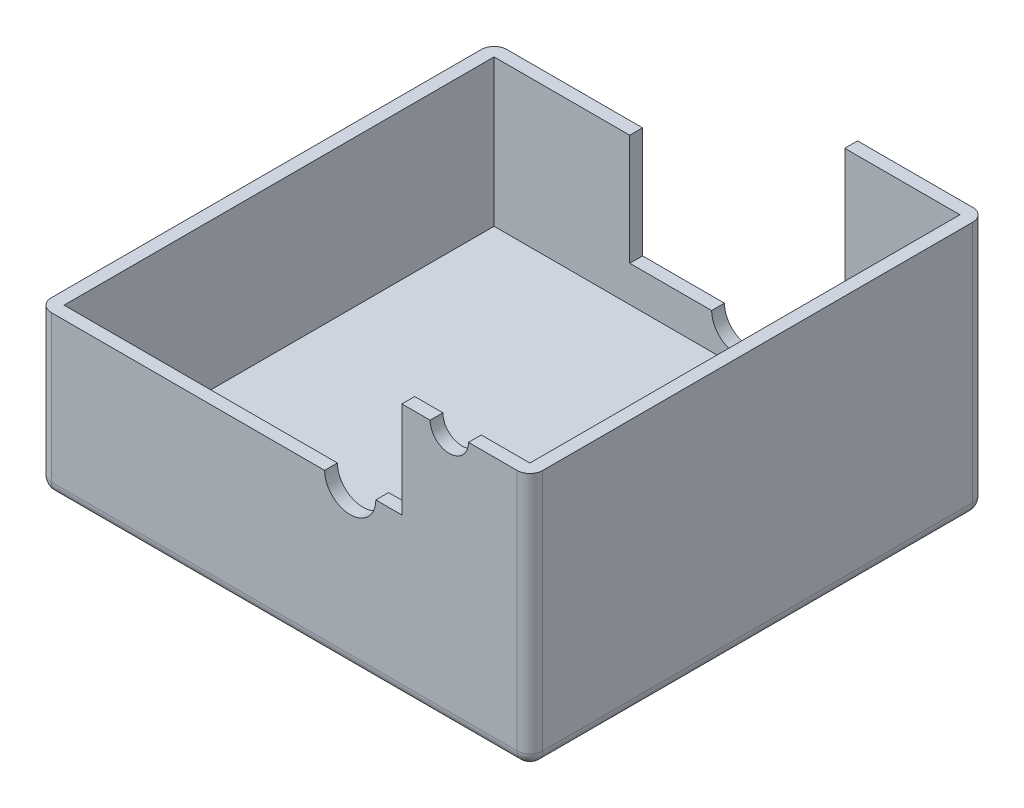
ISO-10303-21;
HEADER;
FILE_DESCRIPTION(('STEP AP214'),'2;1');
FILE_NAME('part.step','',(''),(''),'','','');
FILE_SCHEMA(('AUTOMOTIVE_DESIGN { 1 0 10303 214 1 1 1 1 }'));
ENDSEC;
DATA;
#1=APPLICATION_CONTEXT('core data for automotive mechanical design processes');
#2=APPLICATION_PROTOCOL_DEFINITION('international standard','automotive_design',2000,#1);
#3=PRODUCT_CONTEXT('',#1,'mechanical');
#4=PRODUCT('Part','Part','',(#3));
#5=PRODUCT_RELATED_PRODUCT_CATEGORY('part','',(#4));
#6=PRODUCT_DEFINITION_FORMATION('','',#4);
#7=PRODUCT_DEFINITION_CONTEXT('part definition',#1,'design');
#8=PRODUCT_DEFINITION('design','',#6,#7);
#9=PRODUCT_DEFINITION_SHAPE('','',#8);
#10=(LENGTH_UNIT() NAMED_UNIT(*) SI_UNIT(.MILLI.,.METRE.));
#11=(NAMED_UNIT(*) PLANE_ANGLE_UNIT() SI_UNIT($,.RADIAN.));
#12=(NAMED_UNIT(*) SI_UNIT($,.STERADIAN.) SOLID_ANGLE_UNIT());
#13=UNCERTAINTY_MEASURE_WITH_UNIT(LENGTH_MEASURE(1.E-05),#10,'distance_accuracy_value','');
#14=(GEOMETRIC_REPRESENTATION_CONTEXT(3) GLOBAL_UNCERTAINTY_ASSIGNED_CONTEXT((#13)) GLOBAL_UNIT_ASSIGNED_CONTEXT((#10,
#11,#12)) REPRESENTATION_CONTEXT('',''));
#15=CARTESIAN_POINT('',(0.,0.,0.));
#16=DIRECTION('',(0.,0.,1.));
#17=DIRECTION('',(1.,0.,0.));
#18=AXIS2_PLACEMENT_3D('',#15,#16,#17);
#19=CARTESIAN_POINT('',(71.,9.5,2.5));
#20=DIRECTION('',(0.,-1.,0.));
#21=DIRECTION('',(0.,0.,-1.));
#22=AXIS2_PLACEMENT_3D('',#19,#20,#21);
#23=PLANE('',#22);
#24=DIRECTION('',(-1.,0.,0.));
#25=VECTOR('',#24,1.);
#26=CARTESIAN_POINT('',(71.,9.5,2.5));
#27=LINE('',#26,#25);
#28=CARTESIAN_POINT('',(45.,9.5,2.5));
#29=VERTEX_POINT('',#28);
#30=CARTESIAN_POINT('',(29.,9.5,2.5));
#31=VERTEX_POINT('',#30);
#32=EDGE_CURVE('E223',#29,#31,#27,.T.);
#33=ORIENTED_EDGE('',*,*,#32,.F.);
#34=DIRECTION('',(0.,0.,-1.));
#35=VECTOR('',#34,1.);
#36=CARTESIAN_POINT('',(45.,9.5,2.5));
#37=LINE('',#36,#35);
#38=CARTESIAN_POINT('',(45.,9.5,0.));
#39=VERTEX_POINT('',#38);
#40=EDGE_CURVE('E207',#29,#39,#37,.T.);
#41=ORIENTED_EDGE('',*,*,#40,.T.);
#42=DIRECTION('',(-1.,0.,0.));
#43=VECTOR('',#42,1.);
#44=CARTESIAN_POINT('',(71.,9.5,0.));
#45=LINE('',#44,#43);
#46=CARTESIAN_POINT('',(29.,9.5,0.));
#47=VERTEX_POINT('',#46);
#48=EDGE_CURVE('E242',#39,#47,#45,.T.);
#49=ORIENTED_EDGE('',*,*,#48,.T.);
#50=DIRECTION('',(0.,0.,-1.));
#51=VECTOR('',#50,1.);
#52=CARTESIAN_POINT('',(29.,9.5,2.5));
#53=LINE('',#52,#51);
#54=EDGE_CURVE('E229',#31,#47,#53,.T.);
#55=ORIENTED_EDGE('',*,*,#54,.F.);
#56=EDGE_LOOP('',(#33,#41,#49,#55));
#57=FACE_BOUND('',#56,.T.);
#58=ADVANCED_FACE('F36',(#57),#23,.F.);
#59=CARTESIAN_POINT('',(96.,49.95,0.));
#60=DIRECTION('',(0.,-1.,0.));
#61=DIRECTION('',(0.,0.,-1.));
#62=AXIS2_PLACEMENT_3D('',#59,#60,#61);
#63=PLANE('',#62);
#64=DIRECTION('',(1.,0.,0.));
#65=VECTOR('',#64,1.);
#66=CARTESIAN_POINT('',(96.,49.95,89.));
#67=LINE('',#66,#65);
#68=CARTESIAN_POINT('',(84.,49.95,89.));
#69=VERTEX_POINT('',#68);
#70=CARTESIAN_POINT('',(93.5,49.95,89.));
#71=VERTEX_POINT('',#70);
#72=EDGE_CURVE('E266',#69,#71,#67,.T.);
#73=ORIENTED_EDGE('',*,*,#72,.T.);
#74=CARTESIAN_POINT('',(93.5,49.95,86.5));
#75=DIRECTION('',(0.,-1.,0.));
#76=DIRECTION('',(0.,0.,-1.));
#77=AXIS2_PLACEMENT_3D('',#74,#75,#76);
#78=CIRCLE('',#77,2.5);
#79=CARTESIAN_POINT('',(96.,49.95,86.5));
#80=VERTEX_POINT('',#79);
#81=EDGE_CURVE('E384',#71,#80,#78,.F.);
#82=ORIENTED_EDGE('',*,*,#81,.T.);
#83=DIRECTION('',(0.,0.,1.));
#84=VECTOR('',#83,1.);
#85=CARTESIAN_POINT('',(96.,49.95,0.));
#86=LINE('',#85,#84);
#87=CARTESIAN_POINT('',(96.,49.95,2.5));
#88=VERTEX_POINT('',#87);
#89=EDGE_CURVE('E275',#88,#80,#86,.T.);
#90=ORIENTED_EDGE('',*,*,#89,.F.);
#91=CARTESIAN_POINT('',(93.5,49.95,2.5));
#92=DIRECTION('',(0.,-1.,0.));
#93=DIRECTION('',(0.,0.,-1.));
#94=AXIS2_PLACEMENT_3D('',#91,#92,#93);
#95=CIRCLE('',#94,2.5);
#96=CARTESIAN_POINT('',(93.5,49.95,0.));
#97=VERTEX_POINT('',#96);
#98=EDGE_CURVE('E382',#88,#97,#95,.F.);
#99=ORIENTED_EDGE('',*,*,#98,.T.);
#100=DIRECTION('',(1.,0.,0.));
#101=VECTOR('',#100,1.);
#102=CARTESIAN_POINT('',(80.25,49.95,0.));
#103=LINE('',#102,#101);
#104=CARTESIAN_POINT('',(71.,49.95,0.));
#105=VERTEX_POINT('',#104);
#106=EDGE_CURVE('E267',#105,#97,#103,.T.);
#107=ORIENTED_EDGE('',*,*,#106,.F.);
#108=DIRECTION('',(0.,0.,1.));
#109=VECTOR('',#108,1.);
#110=CARTESIAN_POINT('',(71.,49.95,0.));
#111=LINE('',#110,#109);
#112=CARTESIAN_POINT('',(71.,49.95,2.5));
#113=VERTEX_POINT('',#112);
#114=EDGE_CURVE('E284',#105,#113,#111,.T.);
#115=ORIENTED_EDGE('',*,*,#114,.T.);
#116=DIRECTION('',(-1.,0.,0.));
#117=VECTOR('',#116,1.);
#118=CARTESIAN_POINT('',(93.5,49.95,2.5));
#119=LINE('',#118,#117);
#120=CARTESIAN_POINT('',(93.5,49.95,2.5));
#121=VERTEX_POINT('',#120);
#122=EDGE_CURVE('E305',#121,#113,#119,.T.);
#123=ORIENTED_EDGE('',*,*,#122,.F.);
#124=DIRECTION('',(0.,0.,-1.));
#125=VECTOR('',#124,1.);
#126=CARTESIAN_POINT('',(93.5,49.95,86.5));
#127=LINE('',#126,#125);
#128=CARTESIAN_POINT('',(93.5,49.95,86.5));
#129=VERTEX_POINT('',#128);
#130=EDGE_CURVE('E302',#129,#121,#127,.T.);
#131=ORIENTED_EDGE('',*,*,#130,.F.);
#132=DIRECTION('',(1.,0.,0.));
#133=VECTOR('',#132,1.);
#134=CARTESIAN_POINT('',(2.50000000000001,49.95,86.5));
#135=LINE('',#134,#133);
#136=CARTESIAN_POINT('',(84.,49.95,86.5));
#137=VERTEX_POINT('',#136);
#138=EDGE_CURVE('E337',#137,#129,#135,.T.);
#139=ORIENTED_EDGE('',*,*,#138,.F.);
#140=DIRECTION('',(0.,0.,1.));
#141=VECTOR('',#140,1.);
#142=CARTESIAN_POINT('',(84.,49.95,86.5));
#143=LINE('',#142,#141);
#144=EDGE_CURVE('E263',#137,#69,#143,.T.);
#145=ORIENTED_EDGE('',*,*,#144,.T.);
#146=EDGE_LOOP('',(#73,#82,#90,#99,#107,#115,#123,#131,#139,#145));
#147=FACE_BOUND('',#146,.T.);
#148=ADVANCED_FACE('F483',(#147),#63,.F.);
#149=CARTESIAN_POINT('',(71.,31.16,0.));
#150=DIRECTION('',(0.,-1.,0.));
#151=DIRECTION('',(1.,0.,0.));
#152=AXIS2_PLACEMENT_3D('',#149,#150,#151);
#153=PLANE('',#152);
#154=DIRECTION('',(1.,0.,0.));
#155=VECTOR('',#154,1.);
#156=CARTESIAN_POINT('',(2.50000000000001,31.16,86.5));
#157=LINE('',#156,#155);
#158=CARTESIAN_POINT('',(65.9,31.16,86.5));
#159=VERTEX_POINT('',#158);
#160=CARTESIAN_POINT('',(71.,31.16,86.5));
#161=VERTEX_POINT('',#160);
#162=EDGE_CURVE('E287',#159,#161,#157,.T.);
#163=ORIENTED_EDGE('',*,*,#162,.F.);
#164=DIRECTION('',(0.,0.,1.));
#165=VECTOR('',#164,1.);
#166=CARTESIAN_POINT('',(65.9,31.16,86.5));
#167=LINE('',#166,#165);
#168=CARTESIAN_POINT('',(65.9,31.16,89.));
#169=VERTEX_POINT('',#168);
#170=EDGE_CURVE('E257',#159,#169,#167,.T.);
#171=ORIENTED_EDGE('',*,*,#170,.T.);
#172=DIRECTION('',(1.,0.,0.));
#173=VECTOR('',#172,1.);
#174=CARTESIAN_POINT('',(71.,31.16,89.));
#175=LINE('',#174,#173);
#176=CARTESIAN_POINT('',(71.,31.16,89.));
#177=VERTEX_POINT('',#176);
#178=EDGE_CURVE('E279',#169,#177,#175,.T.);
#179=ORIENTED_EDGE('',*,*,#178,.T.);
#180=DIRECTION('',(0.,0.,1.));
#181=VECTOR('',#180,1.);
#182=CARTESIAN_POINT('',(71.,31.16,0.));
#183=LINE('',#182,#181);
#184=EDGE_CURVE('E289',#161,#177,#183,.T.);
#185=ORIENTED_EDGE('',*,*,#184,.F.);
#186=EDGE_LOOP('',(#163,#171,#179,#185));
#187=FACE_BOUND('',#186,.T.);
#188=ADVANCED_FACE('F468',(#187),#153,.F.);
#189=CARTESIAN_POINT('',(0.,72.5,0.));
#190=DIRECTION('',(1.,0.,0.));
#191=DIRECTION('',(0.,0.,-1.));
#192=AXIS2_PLACEMENT_3D('',#189,#190,#191);
#193=PLANE('',#192);
#194=DIRECTION('',(0.,0.,1.));
#195=VECTOR('',#194,1.);
#196=CARTESIAN_POINT('',(0.,2.5,0.));
#197=LINE('',#196,#195);
#198=CARTESIAN_POINT('',(0.,2.5,2.5));
#199=VERTEX_POINT('',#198);
#200=CARTESIAN_POINT('',(0.,2.5,86.5));
#201=VERTEX_POINT('',#200);
#202=EDGE_CURVE('E359',#199,#201,#197,.T.);
#203=ORIENTED_EDGE('',*,*,#202,.T.);
#204=DIRECTION('',(0.,-1.,0.));
#205=VECTOR('',#204,1.);
#206=CARTESIAN_POINT('',(0.,72.5,86.5));
#207=LINE('',#206,#205);
#208=CARTESIAN_POINT('',(0.,31.16,86.5));
#209=VERTEX_POINT('',#208);
#210=EDGE_CURVE('E361',#201,#209,#207,.F.);
#211=ORIENTED_EDGE('',*,*,#210,.T.);
#212=DIRECTION('',(0.,0.,1.));
#213=VECTOR('',#212,1.);
#214=CARTESIAN_POINT('',(0.,31.16,0.));
#215=LINE('',#214,#213);
#216=CARTESIAN_POINT('',(0.,31.16,2.5));
#217=VERTEX_POINT('',#216);
#218=EDGE_CURVE('E292',#217,#209,#215,.T.);
#219=ORIENTED_EDGE('',*,*,#218,.F.);
#220=DIRECTION('',(0.,-1.,0.));
#221=VECTOR('',#220,1.);
#222=CARTESIAN_POINT('',(0.,72.5,2.5));
#223=LINE('',#222,#221);
#224=EDGE_CURVE('E357',#217,#199,#223,.T.);
#225=ORIENTED_EDGE('',*,*,#224,.T.);
#226=EDGE_LOOP('',(#203,#211,#219,#225));
#227=FACE_BOUND('',#226,.T.);
#228=ADVANCED_FACE('F443',(#227),#193,.F.);
#229=CARTESIAN_POINT('',(0.,72.5,89.));
#230=DIRECTION('',(0.,0.,-1.));
#231=DIRECTION('',(-1.,0.,0.));
#232=AXIS2_PLACEMENT_3D('',#229,#230,#231);
#233=PLANE('',#232);
#234=CARTESIAN_POINT('',(2.50000000000002,31.16,89.));
#235=VERTEX_POINT('',#234);
#236=CARTESIAN_POINT('',(55.9,31.16,89.));
#237=VERTEX_POINT('',#236);
#238=EDGE_CURVE('E280',#235,#237,#175,.T.);
#239=ORIENTED_EDGE('',*,*,#238,.F.);
#240=DIRECTION('',(0.,-1.,0.));
#241=VECTOR('',#240,1.);
#242=CARTESIAN_POINT('',(2.50000000000001,72.5,89.));
#243=LINE('',#242,#241);
#244=CARTESIAN_POINT('',(2.50000000000001,2.5,89.));
#245=VERTEX_POINT('',#244);
#246=EDGE_CURVE('E354',#235,#245,#243,.T.);
#247=ORIENTED_EDGE('',*,*,#246,.T.);
#248=DIRECTION('',(1.,0.,0.));
#249=VECTOR('',#248,1.);
#250=CARTESIAN_POINT('',(0.,2.5,89.));
#251=LINE('',#250,#249);
#252=CARTESIAN_POINT('',(93.5,2.5,89.));
#253=VERTEX_POINT('',#252);
#254=EDGE_CURVE('E352',#245,#253,#251,.T.);
#255=ORIENTED_EDGE('',*,*,#254,.T.);
#256=DIRECTION('',(0.,-1.,0.));
#257=VECTOR('',#256,1.);
#258=CARTESIAN_POINT('',(93.5,72.5,89.));
#259=LINE('',#258,#257);
#260=EDGE_CURVE('E350',#253,#71,#259,.F.);
#261=ORIENTED_EDGE('',*,*,#260,.T.);
#262=ORIENTED_EDGE('',*,*,#72,.F.);
#263=CARTESIAN_POINT('',(80.25,49.95,89.));
#264=DIRECTION('',(0.,0.,1.));
#265=DIRECTION('',(1.,0.,0.));
#266=AXIS2_PLACEMENT_3D('',#263,#264,#265);
#267=CIRCLE('',#266,3.75000000000001);
#268=CARTESIAN_POINT('',(76.5,49.95,89.));
#269=VERTEX_POINT('',#268);
#270=EDGE_CURVE('E251',#269,#69,#267,.T.);
#271=ORIENTED_EDGE('',*,*,#270,.F.);
#272=CARTESIAN_POINT('',(71.,49.95,89.));
#273=VERTEX_POINT('',#272);
#274=EDGE_CURVE('E276',#273,#269,#67,.T.);
#275=ORIENTED_EDGE('',*,*,#274,.F.);
#276=DIRECTION('',(0.,1.,0.));
#277=VECTOR('',#276,1.);
#278=CARTESIAN_POINT('',(71.,49.95,89.));
#279=LINE('',#278,#277);
#280=EDGE_CURVE('E270',#177,#273,#279,.T.);
#281=ORIENTED_EDGE('',*,*,#280,.F.);
#282=ORIENTED_EDGE('',*,*,#178,.F.);
#283=CARTESIAN_POINT('',(60.9,31.16,89.));
#284=DIRECTION('',(0.,0.,1.));
#285=DIRECTION('',(1.,0.,0.));
#286=AXIS2_PLACEMENT_3D('',#283,#284,#285);
#287=CIRCLE('',#286,5.00000000000001);
#288=EDGE_CURVE('E247',#237,#169,#287,.T.);
#289=ORIENTED_EDGE('',*,*,#288,.F.);
#290=EDGE_LOOP('',(#239,#247,#255,#261,#262,#271,#275,#281,#282,#289));
#291=FACE_BOUND('',#290,.T.);
#292=ADVANCED_FACE('F454',(#291),#233,.F.);
#293=CARTESIAN_POINT('',(96.,72.5,0.));
#294=DIRECTION('',(-1.,0.,0.));
#295=DIRECTION('',(0.,0.,1.));
#296=AXIS2_PLACEMENT_3D('',#293,#294,#295);
#297=PLANE('',#296);
#298=ORIENTED_EDGE('',*,*,#89,.T.);
#299=DIRECTION('',(0.,-1.,0.));
#300=VECTOR('',#299,1.);
#301=CARTESIAN_POINT('',(96.,72.5,86.5));
#302=LINE('',#301,#300);
#303=CARTESIAN_POINT('',(96.,2.5,86.5));
#304=VERTEX_POINT('',#303);
#305=EDGE_CURVE('E380',#80,#304,#302,.T.);
#306=ORIENTED_EDGE('',*,*,#305,.T.);
#307=DIRECTION('',(0.,0.,-1.));
#308=VECTOR('',#307,1.);
#309=CARTESIAN_POINT('',(96.,2.5,0.));
#310=LINE('',#309,#308);
#311=CARTESIAN_POINT('',(96.,2.5,2.5));
#312=VERTEX_POINT('',#311);
#313=EDGE_CURVE('E378',#304,#312,#310,.T.);
#314=ORIENTED_EDGE('',*,*,#313,.T.);
#315=DIRECTION('',(0.,-1.,0.));
#316=VECTOR('',#315,1.);
#317=CARTESIAN_POINT('',(96.,72.5,2.5));
#318=LINE('',#317,#316);
#319=EDGE_CURVE('E376',#312,#88,#318,.F.);
#320=ORIENTED_EDGE('',*,*,#319,.T.);
#321=EDGE_LOOP('',(#298,#306,#314,#320));
#322=FACE_BOUND('',#321,.T.);
#323=ADVANCED_FACE('F531',(#322),#297,.F.);
#324=CARTESIAN_POINT('',(0.,72.5,0.));
#325=DIRECTION('',(0.,0.,1.));
#326=DIRECTION('',(1.,0.,0.));
#327=AXIS2_PLACEMENT_3D('',#324,#325,#326);
#328=PLANE('',#327);
#329=ORIENTED_EDGE('',*,*,#106,.T.);
#330=DIRECTION('',(0.,-1.,0.));
#331=VECTOR('',#330,1.);
#332=CARTESIAN_POINT('',(93.5,72.5,0.));
#333=LINE('',#332,#331);
#334=CARTESIAN_POINT('',(93.5,2.5,0.));
#335=VERTEX_POINT('',#334);
#336=EDGE_CURVE('E11',#97,#335,#333,.T.);
#337=ORIENTED_EDGE('',*,*,#336,.T.);
#338=DIRECTION('',(-1.,0.,0.));
#339=VECTOR('',#338,1.);
#340=CARTESIAN_POINT('',(0.,2.5,0.));
#341=LINE('',#340,#339);
#342=CARTESIAN_POINT('',(2.5,2.5,0.));
#343=VERTEX_POINT('',#342);
#344=EDGE_CURVE('E45',#335,#343,#341,.T.);
#345=ORIENTED_EDGE('',*,*,#344,.T.);
#346=DIRECTION('',(0.,-1.,0.));
#347=VECTOR('',#346,1.);
#348=CARTESIAN_POINT('',(2.5,72.5,0.));
#349=LINE('',#348,#347);
#350=CARTESIAN_POINT('',(2.5,31.16,0.));
#351=VERTEX_POINT('',#350);
#352=EDGE_CURVE('E386',#343,#351,#349,.F.);
#353=ORIENTED_EDGE('',*,*,#352,.T.);
#354=DIRECTION('',(1.,0.,0.));
#355=VECTOR('',#354,1.);
#356=CARTESIAN_POINT('',(71.,31.16,0.));
#357=LINE('',#356,#355);
#358=CARTESIAN_POINT('',(29.,31.16,0.));
#359=VERTEX_POINT('',#358);
#360=EDGE_CURVE('E269',#351,#359,#357,.T.);
#361=ORIENTED_EDGE('',*,*,#360,.T.);
#362=DIRECTION('',(0.,1.,0.));
#363=VECTOR('',#362,1.);
#364=CARTESIAN_POINT('',(29.,9.5,0.));
#365=LINE('',#364,#363);
#366=EDGE_CURVE('E231',#47,#359,#365,.T.);
#367=ORIENTED_EDGE('',*,*,#366,.F.);
#368=ORIENTED_EDGE('',*,*,#48,.F.);
#369=CARTESIAN_POINT('',(50.,9.5,0.));
#370=DIRECTION('',(0.,0.,-1.));
#371=DIRECTION('',(-1.,0.,0.));
#372=AXIS2_PLACEMENT_3D('',#369,#370,#371);
#373=CIRCLE('',#372,5.);
#374=CARTESIAN_POINT('',(55.,9.5,0.));
#375=VERTEX_POINT('',#374);
#376=EDGE_CURVE('E213',#375,#39,#373,.T.);
#377=ORIENTED_EDGE('',*,*,#376,.F.);
#378=CARTESIAN_POINT('',(71.,9.5,0.));
#379=VERTEX_POINT('',#378);
#380=EDGE_CURVE('E235',#379,#375,#45,.T.);
#381=ORIENTED_EDGE('',*,*,#380,.F.);
#382=DIRECTION('',(0.,1.,0.));
#383=VECTOR('',#382,1.);
#384=CARTESIAN_POINT('',(71.,49.95,0.));
#385=LINE('',#384,#383);
#386=EDGE_CURVE('E272',#379,#105,#385,.T.);
#387=ORIENTED_EDGE('',*,*,#386,.T.);
#388=EDGE_LOOP('',(#329,#337,#345,#353,#361,#367,#368,#377,#381,#387));
#389=FACE_BOUND('',#388,.T.);
#390=ADVANCED_FACE('F429',(#389),#328,.F.);
#391=CARTESIAN_POINT('',(0.,0.,0.));
#392=DIRECTION('',(0.,1.,0.));
#393=DIRECTION('',(0.,0.,1.));
#394=AXIS2_PLACEMENT_3D('',#391,#392,#393);
#395=PLANE('',#394);
#396=DIRECTION('',(0.,0.,-1.));
#397=VECTOR('',#396,1.);
#398=CARTESIAN_POINT('',(93.5,0.,0.));
#399=LINE('',#398,#397);
#400=CARTESIAN_POINT('',(93.5,0.,2.5));
#401=VERTEX_POINT('',#400);
#402=CARTESIAN_POINT('',(93.5,0.,86.5));
#403=VERTEX_POINT('',#402);
#404=EDGE_CURVE('E371',#401,#403,#399,.F.);
#405=ORIENTED_EDGE('',*,*,#404,.T.);
#406=DIRECTION('',(1.,0.,0.));
#407=VECTOR('',#406,1.);
#408=CARTESIAN_POINT('',(0.,0.,86.5));
#409=LINE('',#408,#407);
#410=CARTESIAN_POINT('',(2.50000000000001,0.,86.5));
#411=VERTEX_POINT('',#410);
#412=EDGE_CURVE('E373',#403,#411,#409,.F.);
#413=ORIENTED_EDGE('',*,*,#412,.T.);
#414=DIRECTION('',(0.,0.,1.));
#415=VECTOR('',#414,1.);
#416=CARTESIAN_POINT('',(2.5,0.,0.));
#417=LINE('',#416,#415);
#418=CARTESIAN_POINT('',(2.5,0.,2.5));
#419=VERTEX_POINT('',#418);
#420=EDGE_CURVE('E369',#411,#419,#417,.F.);
#421=ORIENTED_EDGE('',*,*,#420,.T.);
#422=DIRECTION('',(-1.,0.,0.));
#423=VECTOR('',#422,1.);
#424=CARTESIAN_POINT('',(0.,0.,2.5));
#425=LINE('',#424,#423);
#426=EDGE_CURVE('E367',#419,#401,#425,.F.);
#427=ORIENTED_EDGE('',*,*,#426,.T.);
#428=EDGE_LOOP('',(#405,#413,#421,#427));
#429=FACE_BOUND('',#428,.T.);
#430=ADVANCED_FACE('F534',(#429),#395,.F.);
#431=CARTESIAN_POINT('',(71.,49.95,0.));
#432=DIRECTION('',(1.,0.,0.));
#433=DIRECTION('',(0.,0.,-1.));
#434=AXIS2_PLACEMENT_3D('',#431,#432,#433);
#435=PLANE('',#434);
#436=ORIENTED_EDGE('',*,*,#114,.F.);
#437=ORIENTED_EDGE('',*,*,#386,.F.);
#438=DIRECTION('',(0.,0.,-1.));
#439=VECTOR('',#438,1.);
#440=CARTESIAN_POINT('',(71.,9.5,2.5));
#441=LINE('',#440,#439);
#442=CARTESIAN_POINT('',(71.,9.5,2.5));
#443=VERTEX_POINT('',#442);
#444=EDGE_CURVE('E240',#443,#379,#441,.T.);
#445=ORIENTED_EDGE('',*,*,#444,.F.);
#446=DIRECTION('',(0.,-1.,0.));
#447=VECTOR('',#446,1.);
#448=CARTESIAN_POINT('',(71.,2.49999999999999,2.5));
#449=LINE('',#448,#447);
#450=EDGE_CURVE('E308',#113,#443,#449,.T.);
#451=ORIENTED_EDGE('',*,*,#450,.F.);
#452=EDGE_LOOP('',(#436,#437,#445,#451));
#453=FACE_BOUND('',#452,.T.);
#454=ADVANCED_FACE('F500',(#453),#435,.F.);
#455=ORIENTED_EDGE('',*,*,#184,.T.);
#456=ORIENTED_EDGE('',*,*,#280,.T.);
#457=CARTESIAN_POINT('',(71.,49.95,86.5));
#458=VERTEX_POINT('',#457);
#459=EDGE_CURVE('E288',#458,#273,#111,.T.);
#460=ORIENTED_EDGE('',*,*,#459,.F.);
#461=DIRECTION('',(0.,1.,0.));
#462=VECTOR('',#461,1.);
#463=CARTESIAN_POINT('',(71.,2.49999999999999,86.5));
#464=LINE('',#463,#462);
#465=EDGE_CURVE('E341',#161,#458,#464,.T.);
#466=ORIENTED_EDGE('',*,*,#465,.F.);
#467=EDGE_LOOP('',(#455,#456,#460,#466));
#468=FACE_BOUND('',#467,.T.);
#469=ADVANCED_FACE('F471',(#468),#435,.F.);
#470=ORIENTED_EDGE('',*,*,#274,.T.);
#471=DIRECTION('',(0.,0.,1.));
#472=VECTOR('',#471,1.);
#473=CARTESIAN_POINT('',(76.5,49.95,86.5));
#474=LINE('',#473,#472);
#475=CARTESIAN_POINT('',(76.5,49.95,86.5));
#476=VERTEX_POINT('',#475);
#477=EDGE_CURVE('E260',#269,#476,#474,.F.);
#478=ORIENTED_EDGE('',*,*,#477,.T.);
#479=EDGE_CURVE('E338',#458,#476,#135,.T.);
#480=ORIENTED_EDGE('',*,*,#479,.F.);
#481=ORIENTED_EDGE('',*,*,#459,.T.);
#482=EDGE_LOOP('',(#470,#478,#480,#481));
#483=FACE_BOUND('',#482,.T.);
#484=ADVANCED_FACE('F477',(#483),#63,.F.);
#485=ORIENTED_EDGE('',*,*,#218,.T.);
#486=CARTESIAN_POINT('',(2.50000000000001,31.16,86.5));
#487=DIRECTION('',(0.,-1.,0.));
#488=DIRECTION('',(1.,0.,0.));
#489=AXIS2_PLACEMENT_3D('',#486,#487,#488);
#490=CIRCLE('',#489,2.5);
#491=EDGE_CURVE('E365',#209,#235,#490,.F.);
#492=ORIENTED_EDGE('',*,*,#491,.T.);
#493=ORIENTED_EDGE('',*,*,#238,.T.);
#494=DIRECTION('',(0.,0.,1.));
#495=VECTOR('',#494,1.);
#496=CARTESIAN_POINT('',(55.9,31.16,86.5));
#497=LINE('',#496,#495);
#498=CARTESIAN_POINT('',(55.9,31.16,86.5));
#499=VERTEX_POINT('',#498);
#500=EDGE_CURVE('E253',#237,#499,#497,.F.);
#501=ORIENTED_EDGE('',*,*,#500,.T.);
#502=CARTESIAN_POINT('',(2.50000000000001,31.16,86.5));
#503=VERTEX_POINT('',#502);
#504=EDGE_CURVE('E297',#503,#499,#157,.T.);
#505=ORIENTED_EDGE('',*,*,#504,.F.);
#506=DIRECTION('',(0.,0.,1.));
#507=VECTOR('',#506,1.);
#508=CARTESIAN_POINT('',(2.5,31.16,2.5));
#509=LINE('',#508,#507);
#510=CARTESIAN_POINT('',(2.5,31.16,2.5));
#511=VERTEX_POINT('',#510);
#512=EDGE_CURVE('E326',#511,#503,#509,.T.);
#513=ORIENTED_EDGE('',*,*,#512,.F.);
#514=DIRECTION('',(-1.,0.,0.));
#515=VECTOR('',#514,1.);
#516=CARTESIAN_POINT('',(93.5,31.16,2.5));
#517=LINE('',#516,#515);
#518=CARTESIAN_POINT('',(29.,31.16,2.5));
#519=VERTEX_POINT('',#518);
#520=EDGE_CURVE('E300',#519,#511,#517,.T.);
#521=ORIENTED_EDGE('',*,*,#520,.F.);
#522=DIRECTION('',(0.,0.,-1.));
#523=VECTOR('',#522,1.);
#524=CARTESIAN_POINT('',(29.,31.16,2.5));
#525=LINE('',#524,#523);
#526=EDGE_CURVE('E244',#519,#359,#525,.T.);
#527=ORIENTED_EDGE('',*,*,#526,.T.);
#528=ORIENTED_EDGE('',*,*,#360,.F.);
#529=CARTESIAN_POINT('',(2.5,31.16,2.5));
#530=DIRECTION('',(0.,-1.,0.));
#531=DIRECTION('',(1.,0.,0.));
#532=AXIS2_PLACEMENT_3D('',#529,#530,#531);
#533=CIRCLE('',#532,2.5);
#534=EDGE_CURVE('E363',#351,#217,#533,.F.);
#535=ORIENTED_EDGE('',*,*,#534,.T.);
#536=EDGE_LOOP('',(#485,#492,#493,#501,#505,#513,#521,#527,#528,#535));
#537=FACE_BOUND('',#536,.T.);
#538=ADVANCED_FACE('F433',(#537),#153,.F.);
#539=CARTESIAN_POINT('',(0.,2.49999999999999,0.));
#540=DIRECTION('',(0.,1.,0.));
#541=DIRECTION('',(0.,0.,1.));
#542=AXIS2_PLACEMENT_3D('',#539,#540,#541);
#543=PLANE('',#542);
#544=DIRECTION('',(-1.,0.,0.));
#545=VECTOR('',#544,1.);
#546=CARTESIAN_POINT('',(93.5,2.49999999999999,2.5));
#547=LINE('',#546,#545);
#548=CARTESIAN_POINT('',(93.5,2.49999999999999,2.5));
#549=VERTEX_POINT('',#548);
#550=CARTESIAN_POINT('',(2.5,2.49999999999999,2.5));
#551=VERTEX_POINT('',#550);
#552=EDGE_CURVE('E310',#549,#551,#547,.T.);
#553=ORIENTED_EDGE('',*,*,#552,.T.);
#554=DIRECTION('',(0.,0.,1.));
#555=VECTOR('',#554,1.);
#556=CARTESIAN_POINT('',(2.5,2.49999999999999,2.5));
#557=LINE('',#556,#555);
#558=CARTESIAN_POINT('',(2.50000000000001,2.49999999999999,86.5));
#559=VERTEX_POINT('',#558);
#560=EDGE_CURVE('E313',#551,#559,#557,.T.);
#561=ORIENTED_EDGE('',*,*,#560,.T.);
#562=DIRECTION('',(1.,0.,0.));
#563=VECTOR('',#562,1.);
#564=CARTESIAN_POINT('',(2.50000000000001,2.49999999999999,86.5));
#565=LINE('',#564,#563);
#566=CARTESIAN_POINT('',(93.5,2.49999999999999,86.5));
#567=VERTEX_POINT('',#566);
#568=EDGE_CURVE('E316',#559,#567,#565,.T.);
#569=ORIENTED_EDGE('',*,*,#568,.T.);
#570=DIRECTION('',(0.,0.,-1.));
#571=VECTOR('',#570,1.);
#572=CARTESIAN_POINT('',(93.5,2.49999999999999,86.5));
#573=LINE('',#572,#571);
#574=EDGE_CURVE('E319',#567,#549,#573,.T.);
#575=ORIENTED_EDGE('',*,*,#574,.T.);
#576=EDGE_LOOP('',(#553,#561,#569,#575));
#577=FACE_BOUND('',#576,.T.);
#578=ADVANCED_FACE('F489',(#577),#543,.T.);
#579=CARTESIAN_POINT('',(2.5,2.49999999999999,2.5));
#580=DIRECTION('',(-1.,0.,0.));
#581=DIRECTION('',(0.,0.,1.));
#582=AXIS2_PLACEMENT_3D('',#579,#580,#581);
#583=PLANE('',#582);
#584=DIRECTION('',(0.,1.,0.));
#585=VECTOR('',#584,1.);
#586=CARTESIAN_POINT('',(2.5,2.49999999999999,2.5));
#587=LINE('',#586,#585);
#588=EDGE_CURVE('E322',#551,#511,#587,.T.);
#589=ORIENTED_EDGE('',*,*,#588,.T.);
#590=ORIENTED_EDGE('',*,*,#512,.T.);
#591=DIRECTION('',(0.,1.,0.));
#592=VECTOR('',#591,1.);
#593=CARTESIAN_POINT('',(2.50000000000001,2.49999999999999,86.5));
#594=LINE('',#593,#592);
#595=EDGE_CURVE('E330',#559,#503,#594,.T.);
#596=ORIENTED_EDGE('',*,*,#595,.F.);
#597=ORIENTED_EDGE('',*,*,#560,.F.);
#598=EDGE_LOOP('',(#589,#590,#596,#597));
#599=FACE_BOUND('',#598,.T.);
#600=ADVANCED_FACE('F493',(#599),#583,.F.);
#601=CARTESIAN_POINT('',(2.50000000000001,2.49999999999999,86.5));
#602=DIRECTION('',(0.,0.,1.));
#603=DIRECTION('',(1.,0.,0.));
#604=AXIS2_PLACEMENT_3D('',#601,#602,#603);
#605=PLANE('',#604);
#606=ORIENTED_EDGE('',*,*,#479,.T.);
#607=CARTESIAN_POINT('',(80.25,49.95,86.5));
#608=DIRECTION('',(0.,0.,1.));
#609=DIRECTION('',(1.,0.,0.));
#610=AXIS2_PLACEMENT_3D('',#607,#608,#609);
#611=CIRCLE('',#610,3.75000000000001);
#612=EDGE_CURVE('E347',#476,#137,#611,.T.);
#613=ORIENTED_EDGE('',*,*,#612,.T.);
#614=ORIENTED_EDGE('',*,*,#138,.T.);
#615=DIRECTION('',(0.,1.,0.));
#616=VECTOR('',#615,1.);
#617=CARTESIAN_POINT('',(93.5,2.49999999999999,86.5));
#618=LINE('',#617,#616);
#619=EDGE_CURVE('E327',#567,#129,#618,.T.);
#620=ORIENTED_EDGE('',*,*,#619,.F.);
#621=ORIENTED_EDGE('',*,*,#568,.F.);
#622=ORIENTED_EDGE('',*,*,#595,.T.);
#623=ORIENTED_EDGE('',*,*,#504,.T.);
#624=CARTESIAN_POINT('',(60.9,31.16,86.5));
#625=DIRECTION('',(0.,0.,1.));
#626=DIRECTION('',(1.,0.,0.));
#627=AXIS2_PLACEMENT_3D('',#624,#625,#626);
#628=CIRCLE('',#627,5.00000000000001);
#629=EDGE_CURVE('E344',#499,#159,#628,.T.);
#630=ORIENTED_EDGE('',*,*,#629,.T.);
#631=ORIENTED_EDGE('',*,*,#162,.T.);
#632=ORIENTED_EDGE('',*,*,#465,.T.);
#633=EDGE_LOOP('',(#606,#613,#614,#620,#621,#622,#623,#630,#631,#632));
#634=FACE_BOUND('',#633,.T.);
#635=ADVANCED_FACE('F464',(#634),#605,.F.);
#636=CARTESIAN_POINT('',(93.5,2.49999999999999,86.5));
#637=DIRECTION('',(1.,0.,0.));
#638=DIRECTION('',(0.,0.,-1.));
#639=AXIS2_PLACEMENT_3D('',#636,#637,#638);
#640=PLANE('',#639);
#641=ORIENTED_EDGE('',*,*,#619,.T.);
#642=ORIENTED_EDGE('',*,*,#130,.T.);
#643=DIRECTION('',(0.,1.,0.));
#644=VECTOR('',#643,1.);
#645=CARTESIAN_POINT('',(93.5,2.49999999999999,2.5));
#646=LINE('',#645,#644);
#647=EDGE_CURVE('E323',#549,#121,#646,.T.);
#648=ORIENTED_EDGE('',*,*,#647,.F.);
#649=ORIENTED_EDGE('',*,*,#574,.F.);
#650=EDGE_LOOP('',(#641,#642,#648,#649));
#651=FACE_BOUND('',#650,.T.);
#652=ADVANCED_FACE('F486',(#651),#640,.F.);
#653=CARTESIAN_POINT('',(93.5,2.49999999999999,2.5));
#654=DIRECTION('',(0.,0.,-1.));
#655=DIRECTION('',(-1.,0.,0.));
#656=AXIS2_PLACEMENT_3D('',#653,#654,#655);
#657=PLANE('',#656);
#658=CARTESIAN_POINT('',(55.,9.5,2.5));
#659=VERTEX_POINT('',#658);
#660=EDGE_CURVE('E226',#443,#659,#27,.T.);
#661=ORIENTED_EDGE('',*,*,#660,.T.);
#662=CARTESIAN_POINT('',(50.,9.5,2.5));
#663=DIRECTION('',(0.,0.,-1.));
#664=DIRECTION('',(-1.,0.,0.));
#665=AXIS2_PLACEMENT_3D('',#662,#663,#664);
#666=CIRCLE('',#665,5.);
#667=EDGE_CURVE('E210',#659,#29,#666,.T.);
#668=ORIENTED_EDGE('',*,*,#667,.T.);
#669=ORIENTED_EDGE('',*,*,#32,.T.);
#670=DIRECTION('',(0.,1.,0.));
#671=VECTOR('',#670,1.);
#672=CARTESIAN_POINT('',(29.,9.5,2.5));
#673=LINE('',#672,#671);
#674=EDGE_CURVE('E233',#31,#519,#673,.T.);
#675=ORIENTED_EDGE('',*,*,#674,.T.);
#676=ORIENTED_EDGE('',*,*,#520,.T.);
#677=ORIENTED_EDGE('',*,*,#588,.F.);
#678=ORIENTED_EDGE('',*,*,#552,.F.);
#679=ORIENTED_EDGE('',*,*,#647,.T.);
#680=ORIENTED_EDGE('',*,*,#122,.T.);
#681=ORIENTED_EDGE('',*,*,#450,.T.);
#682=EDGE_LOOP('',(#661,#668,#669,#675,#676,#677,#678,#679,#680,#681));
#683=FACE_BOUND('',#682,.T.);
#684=ADVANCED_FACE('F221',(#683),#657,.F.);
#685=CARTESIAN_POINT('',(60.9,31.16,86.5));
#686=DIRECTION('',(0.,0.,1.));
#687=DIRECTION('',(1.,0.,0.));
#688=AXIS2_PLACEMENT_3D('',#685,#686,#687);
#689=CYLINDRICAL_SURFACE('',#688,5.00000000000001);
#690=ORIENTED_EDGE('',*,*,#629,.F.);
#691=ORIENTED_EDGE('',*,*,#500,.F.);
#692=ORIENTED_EDGE('',*,*,#288,.T.);
#693=ORIENTED_EDGE('',*,*,#170,.F.);
#694=EDGE_LOOP('',(#690,#691,#692,#693));
#695=FACE_BOUND('',#694,.T.);
#696=ADVANCED_FACE('F461',(#695),#689,.F.);
#697=CARTESIAN_POINT('',(80.25,49.95,86.5));
#698=DIRECTION('',(0.,0.,1.));
#699=DIRECTION('',(1.,0.,0.));
#700=AXIS2_PLACEMENT_3D('',#697,#698,#699);
#701=CYLINDRICAL_SURFACE('',#700,3.75000000000001);
#702=ORIENTED_EDGE('',*,*,#612,.F.);
#703=ORIENTED_EDGE('',*,*,#477,.F.);
#704=ORIENTED_EDGE('',*,*,#270,.T.);
#705=ORIENTED_EDGE('',*,*,#144,.F.);
#706=EDGE_LOOP('',(#702,#703,#704,#705));
#707=FACE_BOUND('',#706,.T.);
#708=ADVANCED_FACE('F558',(#707),#701,.F.);
#709=CARTESIAN_POINT('',(29.,9.5,2.5));
#710=DIRECTION('',(-1.,0.,0.));
#711=DIRECTION('',(0.,-1.,0.));
#712=AXIS2_PLACEMENT_3D('',#709,#710,#711);
#713=PLANE('',#712);
#714=ORIENTED_EDGE('',*,*,#366,.T.);
#715=ORIENTED_EDGE('',*,*,#526,.F.);
#716=ORIENTED_EDGE('',*,*,#674,.F.);
#717=ORIENTED_EDGE('',*,*,#54,.T.);
#718=EDGE_LOOP('',(#714,#715,#716,#717));
#719=FACE_BOUND('',#718,.T.);
#720=ADVANCED_FACE('F428',(#719),#713,.F.);
#721=ORIENTED_EDGE('',*,*,#380,.T.);
#722=DIRECTION('',(0.,0.,-1.));
#723=VECTOR('',#722,1.);
#724=CARTESIAN_POINT('',(55.,9.5,2.5));
#725=LINE('',#724,#723);
#726=EDGE_CURVE('E217',#659,#375,#725,.T.);
#727=ORIENTED_EDGE('',*,*,#726,.F.);
#728=ORIENTED_EDGE('',*,*,#660,.F.);
#729=ORIENTED_EDGE('',*,*,#444,.T.);
#730=EDGE_LOOP('',(#721,#727,#728,#729));
#731=FACE_BOUND('',#730,.T.);
#732=ADVANCED_FACE('F498',(#731),#23,.F.);
#733=CARTESIAN_POINT('',(50.,9.5,2.5));
#734=DIRECTION('',(0.,0.,-1.));
#735=DIRECTION('',(-1.,0.,0.));
#736=AXIS2_PLACEMENT_3D('',#733,#734,#735);
#737=CYLINDRICAL_SURFACE('',#736,5.);
#738=ORIENTED_EDGE('',*,*,#376,.T.);
#739=ORIENTED_EDGE('',*,*,#40,.F.);
#740=ORIENTED_EDGE('',*,*,#667,.F.);
#741=ORIENTED_EDGE('',*,*,#726,.T.);
#742=EDGE_LOOP('',(#738,#739,#740,#741));
#743=FACE_BOUND('',#742,.T.);
#744=ADVANCED_FACE('F209',(#743),#737,.F.);
#745=CARTESIAN_POINT('',(93.5,72.5,2.5));
#746=DIRECTION('',(0.,-1.,0.));
#747=DIRECTION('',(0.,0.,-1.));
#748=AXIS2_PLACEMENT_3D('',#745,#746,#747);
#749=CYLINDRICAL_SURFACE('',#748,2.5);
#750=CARTESIAN_POINT('',(93.5,2.5,2.5));
#751=DIRECTION('',(0.,-1.,0.));
#752=DIRECTION('',(0.,0.,-1.));
#753=AXIS2_PLACEMENT_3D('',#750,#751,#752);
#754=CIRCLE('',#753,2.5);
#755=EDGE_CURVE('E40',#335,#312,#754,.T.);
#756=ORIENTED_EDGE('',*,*,#755,.F.);
#757=ORIENTED_EDGE('',*,*,#336,.F.);
#758=ORIENTED_EDGE('',*,*,#98,.F.);
#759=ORIENTED_EDGE('',*,*,#319,.F.);
#760=EDGE_LOOP('',(#756,#757,#758,#759));
#761=FACE_BOUND('',#760,.T.);
#762=ADVANCED_FACE('F38',(#761),#749,.T.);
#763=CARTESIAN_POINT('',(93.5,2.5,2.5));
#764=DIRECTION('',(0.,0.,1.));
#765=DIRECTION('',(1.,0.,0.));
#766=AXIS2_PLACEMENT_3D('',#763,#764,#765);
#767=SPHERICAL_SURFACE('',#766,2.5);
#768=CARTESIAN_POINT('',(93.5,2.5,2.5));
#769=DIRECTION('',(1.,0.,0.));
#770=DIRECTION('',(0.,0.,-1.));
#771=AXIS2_PLACEMENT_3D('',#768,#769,#770);
#772=CIRCLE('',#771,2.5);
#773=EDGE_CURVE('E414',#335,#401,#772,.F.);
#774=ORIENTED_EDGE('',*,*,#773,.F.);
#775=ORIENTED_EDGE('',*,*,#755,.T.);
#776=CARTESIAN_POINT('',(93.5,2.5,2.5));
#777=DIRECTION('',(0.,0.,-1.));
#778=DIRECTION('',(-1.,0.,0.));
#779=AXIS2_PLACEMENT_3D('',#776,#777,#778);
#780=CIRCLE('',#779,2.5);
#781=EDGE_CURVE('E416',#401,#312,#780,.F.);
#782=ORIENTED_EDGE('',*,*,#781,.F.);
#783=EDGE_LOOP('',(#774,#775,#782));
#784=FACE_BOUND('',#783,.T.);
#785=ADVANCED_FACE('F505',(#784),#767,.T.);
#786=CARTESIAN_POINT('',(93.5,72.5,86.5));
#787=DIRECTION('',(0.,-1.,0.));
#788=DIRECTION('',(0.,0.,-1.));
#789=AXIS2_PLACEMENT_3D('',#786,#787,#788);
#790=CYLINDRICAL_SURFACE('',#789,2.5);
#791=ORIENTED_EDGE('',*,*,#81,.F.);
#792=ORIENTED_EDGE('',*,*,#260,.F.);
#793=CARTESIAN_POINT('',(93.5,2.5,86.5));
#794=DIRECTION('',(0.,-1.,0.));
#795=DIRECTION('',(0.,0.,-1.));
#796=AXIS2_PLACEMENT_3D('',#793,#794,#795);
#797=CIRCLE('',#796,2.5);
#798=EDGE_CURVE('E411',#304,#253,#797,.T.);
#799=ORIENTED_EDGE('',*,*,#798,.F.);
#800=ORIENTED_EDGE('',*,*,#305,.F.);
#801=EDGE_LOOP('',(#791,#792,#799,#800));
#802=FACE_BOUND('',#801,.T.);
#803=ADVANCED_FACE('F528',(#802),#790,.T.);
#804=CARTESIAN_POINT('',(93.5,2.5,0.));
#805=DIRECTION('',(0.,0.,-1.));
#806=DIRECTION('',(-1.,0.,0.));
#807=AXIS2_PLACEMENT_3D('',#804,#805,#806);
#808=CYLINDRICAL_SURFACE('',#807,2.5);
#809=ORIENTED_EDGE('',*,*,#781,.T.);
#810=ORIENTED_EDGE('',*,*,#313,.F.);
#811=CARTESIAN_POINT('',(93.5,2.5,86.5));
#812=DIRECTION('',(0.,0.,1.));
#813=DIRECTION('',(1.,0.,0.));
#814=AXIS2_PLACEMENT_3D('',#811,#812,#813);
#815=CIRCLE('',#814,2.5);
#816=EDGE_CURVE('E408',#403,#304,#815,.T.);
#817=ORIENTED_EDGE('',*,*,#816,.F.);
#818=ORIENTED_EDGE('',*,*,#404,.F.);
#819=EDGE_LOOP('',(#809,#810,#817,#818));
#820=FACE_BOUND('',#819,.T.);
#821=ADVANCED_FACE('F532',(#820),#808,.T.);
#822=CARTESIAN_POINT('',(0.,2.5,2.5));
#823=DIRECTION('',(-1.,0.,0.));
#824=DIRECTION('',(0.,0.,1.));
#825=AXIS2_PLACEMENT_3D('',#822,#823,#824);
#826=CYLINDRICAL_SURFACE('',#825,2.5);
#827=ORIENTED_EDGE('',*,*,#773,.T.);
#828=ORIENTED_EDGE('',*,*,#426,.F.);
#829=CARTESIAN_POINT('',(2.5,2.5,2.5));
#830=DIRECTION('',(-1.,0.,0.));
#831=DIRECTION('',(0.,0.,1.));
#832=AXIS2_PLACEMENT_3D('',#829,#830,#831);
#833=CIRCLE('',#832,2.5);
#834=EDGE_CURVE('E405',#343,#419,#833,.T.);
#835=ORIENTED_EDGE('',*,*,#834,.F.);
#836=ORIENTED_EDGE('',*,*,#344,.F.);
#837=EDGE_LOOP('',(#827,#828,#835,#836));
#838=FACE_BOUND('',#837,.T.);
#839=ADVANCED_FACE('F508',(#838),#826,.T.);
#840=CARTESIAN_POINT('',(2.5,72.5,2.5));
#841=DIRECTION('',(0.,-1.,0.));
#842=DIRECTION('',(0.,0.,-1.));
#843=AXIS2_PLACEMENT_3D('',#840,#841,#842);
#844=CYLINDRICAL_SURFACE('',#843,2.5);
#845=ORIENTED_EDGE('',*,*,#534,.F.);
#846=ORIENTED_EDGE('',*,*,#352,.F.);
#847=CARTESIAN_POINT('',(2.5,2.5,2.5));
#848=DIRECTION('',(0.,-1.,0.));
#849=DIRECTION('',(0.,0.,-1.));
#850=AXIS2_PLACEMENT_3D('',#847,#848,#849);
#851=CIRCLE('',#850,2.5);
#852=EDGE_CURVE('E402',#199,#343,#851,.T.);
#853=ORIENTED_EDGE('',*,*,#852,.F.);
#854=ORIENTED_EDGE('',*,*,#224,.F.);
#855=EDGE_LOOP('',(#845,#846,#853,#854));
#856=FACE_BOUND('',#855,.T.);
#857=ADVANCED_FACE('F438',(#856),#844,.T.);
#858=CARTESIAN_POINT('',(93.5,2.5,86.5));
#859=DIRECTION('',(0.,0.,1.));
#860=DIRECTION('',(1.,0.,0.));
#861=AXIS2_PLACEMENT_3D('',#858,#859,#860);
#862=SPHERICAL_SURFACE('',#861,2.5);
#863=ORIENTED_EDGE('',*,*,#816,.T.);
#864=ORIENTED_EDGE('',*,*,#798,.T.);
#865=CARTESIAN_POINT('',(93.5,2.5,86.5));
#866=DIRECTION('',(1.,0.,0.));
#867=DIRECTION('',(0.,0.,-1.));
#868=AXIS2_PLACEMENT_3D('',#865,#866,#867);
#869=CIRCLE('',#868,2.5);
#870=EDGE_CURVE('E399',#403,#253,#869,.F.);
#871=ORIENTED_EDGE('',*,*,#870,.F.);
#872=EDGE_LOOP('',(#863,#864,#871));
#873=FACE_BOUND('',#872,.T.);
#874=ADVANCED_FACE('F522',(#873),#862,.T.);
#875=CARTESIAN_POINT('',(2.5,2.5,2.5));
#876=DIRECTION('',(0.,0.,1.));
#877=DIRECTION('',(1.,0.,0.));
#878=AXIS2_PLACEMENT_3D('',#875,#876,#877);
#879=SPHERICAL_SURFACE('',#878,2.5);
#880=ORIENTED_EDGE('',*,*,#852,.T.);
#881=ORIENTED_EDGE('',*,*,#834,.T.);
#882=CARTESIAN_POINT('',(2.5,2.5,2.5));
#883=DIRECTION('',(0.,0.,-1.));
#884=DIRECTION('',(-1.,0.,0.));
#885=AXIS2_PLACEMENT_3D('',#882,#883,#884);
#886=CIRCLE('',#885,2.5);
#887=EDGE_CURVE('E396',#199,#419,#886,.F.);
#888=ORIENTED_EDGE('',*,*,#887,.F.);
#889=EDGE_LOOP('',(#880,#881,#888));
#890=FACE_BOUND('',#889,.T.);
#891=ADVANCED_FACE('F510',(#890),#879,.T.);
#892=CARTESIAN_POINT('',(0.,2.5,86.5));
#893=DIRECTION('',(1.,0.,0.));
#894=DIRECTION('',(0.,0.,-1.));
#895=AXIS2_PLACEMENT_3D('',#892,#893,#894);
#896=CYLINDRICAL_SURFACE('',#895,2.5);
#897=ORIENTED_EDGE('',*,*,#870,.T.);
#898=ORIENTED_EDGE('',*,*,#254,.F.);
#899=CARTESIAN_POINT('',(2.50000000000001,2.5,86.5));
#900=DIRECTION('',(-1.,0.,0.));
#901=DIRECTION('',(0.,0.,1.));
#902=AXIS2_PLACEMENT_3D('',#899,#900,#901);
#903=CIRCLE('',#902,2.5);
#904=EDGE_CURVE('E393',#411,#245,#903,.T.);
#905=ORIENTED_EDGE('',*,*,#904,.F.);
#906=ORIENTED_EDGE('',*,*,#412,.F.);
#907=EDGE_LOOP('',(#897,#898,#905,#906));
#908=FACE_BOUND('',#907,.T.);
#909=ADVANCED_FACE('F519',(#908),#896,.T.);
#910=CARTESIAN_POINT('',(2.5,2.5,0.));
#911=DIRECTION('',(0.,0.,1.));
#912=DIRECTION('',(1.,0.,0.));
#913=AXIS2_PLACEMENT_3D('',#910,#911,#912);
#914=CYLINDRICAL_SURFACE('',#913,2.5);
#915=ORIENTED_EDGE('',*,*,#887,.T.);
#916=ORIENTED_EDGE('',*,*,#420,.F.);
#917=CARTESIAN_POINT('',(2.50000000000001,2.5,86.5));
#918=DIRECTION('',(0.,0.,1.));
#919=DIRECTION('',(1.,0.,0.));
#920=AXIS2_PLACEMENT_3D('',#917,#918,#919);
#921=CIRCLE('',#920,2.5);
#922=EDGE_CURVE('E391',#201,#411,#921,.T.);
#923=ORIENTED_EDGE('',*,*,#922,.F.);
#924=ORIENTED_EDGE('',*,*,#202,.F.);
#925=EDGE_LOOP('',(#915,#916,#923,#924));
#926=FACE_BOUND('',#925,.T.);
#927=ADVANCED_FACE('F513',(#926),#914,.T.);
#928=CARTESIAN_POINT('',(2.50000000000001,2.5,86.5));
#929=DIRECTION('',(0.,0.,1.));
#930=DIRECTION('',(1.,0.,0.));
#931=AXIS2_PLACEMENT_3D('',#928,#929,#930);
#932=SPHERICAL_SURFACE('',#931,2.5);
#933=ORIENTED_EDGE('',*,*,#922,.T.);
#934=ORIENTED_EDGE('',*,*,#904,.T.);
#935=CARTESIAN_POINT('',(2.50000000000001,2.5,86.5));
#936=DIRECTION('',(0.,-1.,0.));
#937=DIRECTION('',(0.,0.,-1.));
#938=AXIS2_PLACEMENT_3D('',#935,#936,#937);
#939=CIRCLE('',#938,2.5);
#940=EDGE_CURVE('E389',#201,#245,#939,.F.);
#941=ORIENTED_EDGE('',*,*,#940,.F.);
#942=EDGE_LOOP('',(#933,#934,#941));
#943=FACE_BOUND('',#942,.T.);
#944=ADVANCED_FACE('F516',(#943),#932,.T.);
#945=CARTESIAN_POINT('',(2.50000000000001,72.5,86.5));
#946=DIRECTION('',(0.,-1.,0.));
#947=DIRECTION('',(0.,0.,-1.));
#948=AXIS2_PLACEMENT_3D('',#945,#946,#947);
#949=CYLINDRICAL_SURFACE('',#948,2.5);
#950=ORIENTED_EDGE('',*,*,#491,.F.);
#951=ORIENTED_EDGE('',*,*,#210,.F.);
#952=ORIENTED_EDGE('',*,*,#940,.T.);
#953=ORIENTED_EDGE('',*,*,#246,.F.);
#954=EDGE_LOOP('',(#950,#951,#952,#953));
#955=FACE_BOUND('',#954,.T.);
#956=ADVANCED_FACE('F451',(#955),#949,.T.);
#957=CLOSED_SHELL('',(#58,#148,#188,#228,#292,#323,#390,#430,#454,#469,#484,#538,#578,#600,#635,
#652,#684,#696,#708,#720,#732,#744,#762,#785,#803,#821,#839,#857,#874,#891,#909,#927,#944,#956));
#958=MANIFOLD_SOLID_BREP('B2',#957);
#959=ADVANCED_BREP_SHAPE_REPRESENTATION('',(#18,#958),#14);
#960=SHAPE_DEFINITION_REPRESENTATION(#9,#959);
ENDSEC;
END-ISO-10303-21;
